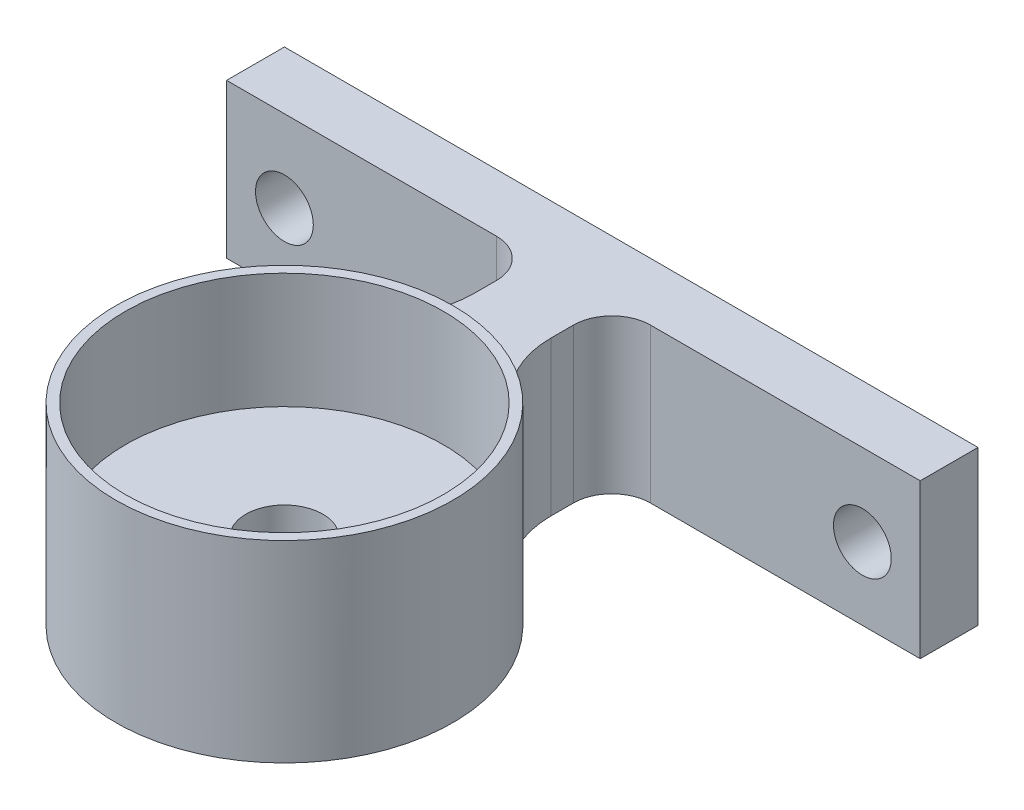
ISO-10303-21;
HEADER;
FILE_DESCRIPTION(('STEP AP214'),'2;1');
FILE_NAME('part.step','',(''),(''),'','','');
FILE_SCHEMA(('AUTOMOTIVE_DESIGN { 1 0 10303 214 1 1 1 1 }'));
ENDSEC;
DATA;
#1=APPLICATION_CONTEXT('core data for automotive mechanical design processes');
#2=APPLICATION_PROTOCOL_DEFINITION('international standard','automotive_design',2000,#1);
#3=PRODUCT_CONTEXT('',#1,'mechanical');
#4=PRODUCT('Part','Part','',(#3));
#5=PRODUCT_RELATED_PRODUCT_CATEGORY('part','',(#4));
#6=PRODUCT_DEFINITION_FORMATION('','',#4);
#7=PRODUCT_DEFINITION_CONTEXT('part definition',#1,'design');
#8=PRODUCT_DEFINITION('design','',#6,#7);
#9=PRODUCT_DEFINITION_SHAPE('','',#8);
#10=(LENGTH_UNIT() NAMED_UNIT(*) SI_UNIT(.MILLI.,.METRE.));
#11=(NAMED_UNIT(*) PLANE_ANGLE_UNIT() SI_UNIT($,.RADIAN.));
#12=(NAMED_UNIT(*) SI_UNIT($,.STERADIAN.) SOLID_ANGLE_UNIT());
#13=UNCERTAINTY_MEASURE_WITH_UNIT(LENGTH_MEASURE(1.E-05),#10,'distance_accuracy_value','');
#14=(GEOMETRIC_REPRESENTATION_CONTEXT(3) GLOBAL_UNCERTAINTY_ASSIGNED_CONTEXT((#13)) GLOBAL_UNIT_ASSIGNED_CONTEXT((#10,
#11,#12)) REPRESENTATION_CONTEXT('',''));
#15=CARTESIAN_POINT('',(0.,0.,0.));
#16=DIRECTION('',(0.,0.,1.));
#17=DIRECTION('',(1.,0.,0.));
#18=AXIS2_PLACEMENT_3D('',#15,#16,#17);
#19=CARTESIAN_POINT('',(-15.,8.,-18.));
#20=DIRECTION('',(0.,0.,1.));
#21=DIRECTION('',(1.,0.,0.));
#22=AXIS2_PLACEMENT_3D('',#19,#20,#21);
#23=PLANE('',#22);
#24=DIRECTION('',(-1.,0.,0.));
#25=VECTOR('',#24,1.);
#26=CARTESIAN_POINT('',(-15.,0.,-18.));
#27=LINE('',#26,#25);
#28=CARTESIAN_POINT('',(18.,0.,-18.));
#29=VERTEX_POINT('',#28);
#30=CARTESIAN_POINT('',(-18.,0.,-18.));
#31=VERTEX_POINT('',#30);
#32=EDGE_CURVE('E123',#29,#31,#27,.T.);
#33=ORIENTED_EDGE('',*,*,#32,.T.);
#34=DIRECTION('',(0.,-1.,0.));
#35=VECTOR('',#34,1.);
#36=CARTESIAN_POINT('',(-18.,8.,-18.));
#37=LINE('',#36,#35);
#38=CARTESIAN_POINT('',(-18.,8.,-18.));
#39=VERTEX_POINT('',#38);
#40=EDGE_CURVE('E127',#39,#31,#37,.T.);
#41=ORIENTED_EDGE('',*,*,#40,.F.);
#42=DIRECTION('',(-1.,0.,0.));
#43=VECTOR('',#42,1.);
#44=CARTESIAN_POINT('',(2.,8.,-18.));
#45=LINE('',#44,#43);
#46=CARTESIAN_POINT('',(18.,8.,-18.));
#47=VERTEX_POINT('',#46);
#48=EDGE_CURVE('E174',#47,#39,#45,.T.);
#49=ORIENTED_EDGE('',*,*,#48,.F.);
#50=DIRECTION('',(0.,1.,0.));
#51=VECTOR('',#50,1.);
#52=CARTESIAN_POINT('',(18.,8.,-18.));
#53=LINE('',#52,#51);
#54=EDGE_CURVE('E129',#29,#47,#53,.T.);
#55=ORIENTED_EDGE('',*,*,#54,.F.);
#56=EDGE_LOOP('',(#33,#41,#49,#55));
#57=FACE_BOUND('',#56,.T.);
#58=CARTESIAN_POINT('',(15.,3.75402103542641,-18.));
#59=DIRECTION('',(0.,0.,-1.));
#60=DIRECTION('',(-1.,0.,0.));
#61=AXIS2_PLACEMENT_3D('',#58,#59,#60);
#62=CIRCLE('',#61,1.5);
#63=CARTESIAN_POINT('',(13.5,3.75402103542641,-18.));
#64=VERTEX_POINT('',#63);
#65=EDGE_CURVE('E152',#64,#64,#62,.T.);
#66=ORIENTED_EDGE('',*,*,#65,.F.);
#67=EDGE_LOOP('',(#66));
#68=FACE_BOUND('',#67,.T.);
#69=CARTESIAN_POINT('',(-15.,3.75402103542641,-18.));
#70=DIRECTION('',(0.,0.,1.));
#71=DIRECTION('',(1.,0.,0.));
#72=AXIS2_PLACEMENT_3D('',#69,#70,#71);
#73=CIRCLE('',#72,1.5);
#74=CARTESIAN_POINT('',(-13.5,3.75402103542641,-18.));
#75=VERTEX_POINT('',#74);
#76=EDGE_CURVE('E494',#75,#75,#73,.T.);
#77=ORIENTED_EDGE('',*,*,#76,.T.);
#78=EDGE_LOOP('',(#77));
#79=FACE_BOUND('',#78,.T.);
#80=ADVANCED_FACE('F34',(#57,#68,#79),#23,.F.);
#81=CARTESIAN_POINT('',(-15.,8.,-15.));
#82=DIRECTION('',(0.,0.,-1.));
#83=DIRECTION('',(-1.,0.,0.));
#84=AXIS2_PLACEMENT_3D('',#81,#82,#83);
#85=PLANE('',#84);
#86=DIRECTION('',(1.,0.,0.));
#87=VECTOR('',#86,1.);
#88=CARTESIAN_POINT('',(-15.,0.,-15.));
#89=LINE('',#88,#87);
#90=CARTESIAN_POINT('',(-18.,0.,-15.));
#91=VERTEX_POINT('',#90);
#92=CARTESIAN_POINT('',(-4.,0.,-15.));
#93=VERTEX_POINT('',#92);
#94=EDGE_CURVE('E132',#91,#93,#89,.T.);
#95=ORIENTED_EDGE('',*,*,#94,.T.);
#96=DIRECTION('',(0.,-1.,0.));
#97=VECTOR('',#96,1.);
#98=CARTESIAN_POINT('',(-4.,8.,-15.));
#99=LINE('',#98,#97);
#100=CARTESIAN_POINT('',(-4.,8.,-15.));
#101=VERTEX_POINT('',#100);
#102=EDGE_CURVE('E229',#93,#101,#99,.F.);
#103=ORIENTED_EDGE('',*,*,#102,.T.);
#104=DIRECTION('',(1.,0.,0.));
#105=VECTOR('',#104,1.);
#106=CARTESIAN_POINT('',(-15.,8.,-15.));
#107=LINE('',#106,#105);
#108=CARTESIAN_POINT('',(-18.,8.,-15.));
#109=VERTEX_POINT('',#108);
#110=EDGE_CURVE('E176',#109,#101,#107,.T.);
#111=ORIENTED_EDGE('',*,*,#110,.F.);
#112=DIRECTION('',(0.,1.,0.));
#113=VECTOR('',#112,1.);
#114=CARTESIAN_POINT('',(-18.,8.,-15.));
#115=LINE('',#114,#113);
#116=EDGE_CURVE('E143',#91,#109,#115,.T.);
#117=ORIENTED_EDGE('',*,*,#116,.F.);
#118=EDGE_LOOP('',(#95,#103,#111,#117));
#119=FACE_BOUND('',#118,.T.);
#120=CARTESIAN_POINT('',(-15.,3.75402103542641,-15.));
#121=DIRECTION('',(0.,0.,1.));
#122=DIRECTION('',(1.,0.,0.));
#123=AXIS2_PLACEMENT_3D('',#120,#121,#122);
#124=CIRCLE('',#123,1.5);
#125=CARTESIAN_POINT('',(-13.5,3.75402103542641,-15.));
#126=VERTEX_POINT('',#125);
#127=EDGE_CURVE('E491',#126,#126,#124,.T.);
#128=ORIENTED_EDGE('',*,*,#127,.F.);
#129=EDGE_LOOP('',(#128));
#130=FACE_BOUND('',#129,.T.);
#131=ADVANCED_FACE('F252',(#119,#130),#85,.F.);
#132=CARTESIAN_POINT('',(0.,10.,0.));
#133=DIRECTION('',(0.,-1.,0.));
#134=DIRECTION('',(0.,0.,-1.));
#135=AXIS2_PLACEMENT_3D('',#132,#133,#134);
#136=CYLINDRICAL_SURFACE('',#135,8.75);
#137=CARTESIAN_POINT('',(0.,10.,0.));
#138=DIRECTION('',(0.,1.,0.));
#139=DIRECTION('',(0.,0.,1.));
#140=AXIS2_PLACEMENT_3D('',#137,#138,#139);
#141=CIRCLE('',#140,8.75);
#142=CARTESIAN_POINT('',(0.,10.,8.75));
#143=VERTEX_POINT('',#142);
#144=EDGE_CURVE('E194',#143,#143,#141,.T.);
#145=ORIENTED_EDGE('',*,*,#144,.F.);
#146=EDGE_LOOP('',(#145));
#147=FACE_BOUND('',#146,.T.);
#148=CARTESIAN_POINT('',(0.,0.,0.));
#149=DIRECTION('',(0.,1.,0.));
#150=DIRECTION('',(0.,0.,1.));
#151=AXIS2_PLACEMENT_3D('',#148,#149,#150);
#152=CIRCLE('',#151,8.75);
#153=CARTESIAN_POINT('',(-4.45454545454546,0.,-7.5312366045284));
#154=VERTEX_POINT('',#153);
#155=CARTESIAN_POINT('',(4.45454545454546,0.,-7.5312366045284));
#156=VERTEX_POINT('',#155);
#157=EDGE_CURVE('E193',#154,#156,#152,.T.);
#158=ORIENTED_EDGE('',*,*,#157,.T.);
#159=DIRECTION('',(0.,-1.,0.));
#160=VECTOR('',#159,1.);
#161=CARTESIAN_POINT('',(4.45454545454546,10.,-7.5312366045284));
#162=LINE('',#161,#160);
#163=CARTESIAN_POINT('',(4.45454545454546,8.,-7.5312366045284));
#164=VERTEX_POINT('',#163);
#165=EDGE_CURVE('E210',#156,#164,#162,.F.);
#166=ORIENTED_EDGE('',*,*,#165,.T.);
#167=CARTESIAN_POINT('',(0.,8.,0.));
#168=DIRECTION('',(0.,-1.,0.));
#169=DIRECTION('',(0.,0.,-1.));
#170=AXIS2_PLACEMENT_3D('',#167,#168,#169);
#171=CIRCLE('',#170,8.75);
#172=CARTESIAN_POINT('',(-4.45454545454546,8.,-7.5312366045284));
#173=VERTEX_POINT('',#172);
#174=EDGE_CURVE('E202',#173,#164,#171,.T.);
#175=ORIENTED_EDGE('',*,*,#174,.F.);
#176=DIRECTION('',(0.,-1.,0.));
#177=VECTOR('',#176,1.);
#178=CARTESIAN_POINT('',(-4.45454545454546,10.,-7.5312366045284));
#179=LINE('',#178,#177);
#180=EDGE_CURVE('E207',#173,#154,#179,.T.);
#181=ORIENTED_EDGE('',*,*,#180,.T.);
#182=EDGE_LOOP('',(#158,#166,#175,#181));
#183=FACE_BOUND('',#182,.T.);
#184=ADVANCED_FACE('F272',(#147,#183),#136,.T.);
#185=CARTESIAN_POINT('',(0.,10.,0.));
#186=DIRECTION('',(0.,1.,0.));
#187=DIRECTION('',(0.,0.,1.));
#188=AXIS2_PLACEMENT_3D('',#185,#186,#187);
#189=PLANE('',#188);
#190=ORIENTED_EDGE('',*,*,#144,.T.);
#191=EDGE_LOOP('',(#190));
#192=FACE_BOUND('',#191,.T.);
#193=CARTESIAN_POINT('',(0.,10.,0.));
#194=DIRECTION('',(0.,1.,0.));
#195=DIRECTION('',(0.,0.,1.));
#196=AXIS2_PLACEMENT_3D('',#193,#194,#195);
#197=CIRCLE('',#196,8.25);
#198=CARTESIAN_POINT('',(0.,10.,8.25));
#199=VERTEX_POINT('',#198);
#200=EDGE_CURVE('E188',#199,#199,#197,.T.);
#201=ORIENTED_EDGE('',*,*,#200,.F.);
#202=EDGE_LOOP('',(#201));
#203=FACE_BOUND('',#202,.T.);
#204=ADVANCED_FACE('F311',(#192,#203),#189,.T.);
#205=CARTESIAN_POINT('',(0.,0.,0.));
#206=DIRECTION('',(0.,1.,0.));
#207=DIRECTION('',(0.,0.,1.));
#208=AXIS2_PLACEMENT_3D('',#205,#206,#207);
#209=PLANE('',#208);
#210=DIRECTION('',(0.,0.,-1.));
#211=VECTOR('',#210,1.);
#212=CARTESIAN_POINT('',(2.,0.,-8.51836251870041));
#213=LINE('',#212,#211);
#214=CARTESIAN_POINT('',(2.,0.,-11.8348003785446));
#215=VERTEX_POINT('',#214);
#216=CARTESIAN_POINT('',(2.,0.,-13.));
#217=VERTEX_POINT('',#216);
#218=EDGE_CURVE('E181',#215,#217,#213,.T.);
#219=ORIENTED_EDGE('',*,*,#218,.F.);
#220=CARTESIAN_POINT('',(7.,0.,-11.8348003785446));
#221=DIRECTION('',(0.,1.,0.));
#222=DIRECTION('',(0.,0.,1.));
#223=AXIS2_PLACEMENT_3D('',#220,#221,#222);
#224=CIRCLE('',#223,5.);
#225=EDGE_CURVE('E216',#215,#156,#224,.T.);
#226=ORIENTED_EDGE('',*,*,#225,.T.);
#227=ORIENTED_EDGE('',*,*,#157,.F.);
#228=CARTESIAN_POINT('',(-7.,0.,-11.8348003785446));
#229=DIRECTION('',(0.,1.,0.));
#230=DIRECTION('',(0.,0.,1.));
#231=AXIS2_PLACEMENT_3D('',#228,#229,#230);
#232=CIRCLE('',#231,5.);
#233=CARTESIAN_POINT('',(-2.,0.,-11.8348003785446));
#234=VERTEX_POINT('',#233);
#235=EDGE_CURVE('E220',#154,#234,#232,.T.);
#236=ORIENTED_EDGE('',*,*,#235,.T.);
#237=DIRECTION('',(0.,0.,1.));
#238=VECTOR('',#237,1.);
#239=CARTESIAN_POINT('',(-2.,0.,-8.51836251870041));
#240=LINE('',#239,#238);
#241=CARTESIAN_POINT('',(-2.,0.,-13.));
#242=VERTEX_POINT('',#241);
#243=EDGE_CURVE('E167',#242,#234,#240,.T.);
#244=ORIENTED_EDGE('',*,*,#243,.F.);
#245=CARTESIAN_POINT('',(-4.,0.,-13.));
#246=DIRECTION('',(0.,1.,0.));
#247=DIRECTION('',(0.,0.,1.));
#248=AXIS2_PLACEMENT_3D('',#245,#246,#247);
#249=CIRCLE('',#248,2.);
#250=EDGE_CURVE('E235',#242,#93,#249,.T.);
#251=ORIENTED_EDGE('',*,*,#250,.T.);
#252=ORIENTED_EDGE('',*,*,#94,.F.);
#253=DIRECTION('',(0.,0.,1.));
#254=VECTOR('',#253,1.);
#255=CARTESIAN_POINT('',(-18.,0.,-18.));
#256=LINE('',#255,#254);
#257=EDGE_CURVE('E136',#31,#91,#256,.T.);
#258=ORIENTED_EDGE('',*,*,#257,.F.);
#259=ORIENTED_EDGE('',*,*,#32,.F.);
#260=DIRECTION('',(0.,0.,-1.));
#261=VECTOR('',#260,1.);
#262=CARTESIAN_POINT('',(18.,0.,-15.));
#263=LINE('',#262,#261);
#264=CARTESIAN_POINT('',(18.,0.,-15.));
#265=VERTEX_POINT('',#264);
#266=EDGE_CURVE('E161',#265,#29,#263,.T.);
#267=ORIENTED_EDGE('',*,*,#266,.F.);
#268=DIRECTION('',(1.,0.,0.));
#269=VECTOR('',#268,1.);
#270=CARTESIAN_POINT('',(2.,0.,-15.));
#271=LINE('',#270,#269);
#272=CARTESIAN_POINT('',(4.,0.,-15.));
#273=VERTEX_POINT('',#272);
#274=EDGE_CURVE('E133',#273,#265,#271,.T.);
#275=ORIENTED_EDGE('',*,*,#274,.F.);
#276=CARTESIAN_POINT('',(4.,0.,-13.));
#277=DIRECTION('',(0.,1.,0.));
#278=DIRECTION('',(0.,0.,1.));
#279=AXIS2_PLACEMENT_3D('',#276,#277,#278);
#280=CIRCLE('',#279,2.);
#281=EDGE_CURVE('E42',#273,#217,#280,.T.);
#282=ORIENTED_EDGE('',*,*,#281,.T.);
#283=EDGE_LOOP('',(#219,#226,#227,#236,#244,#251,#252,#258,#259,#267,#275,#282));
#284=FACE_BOUND('',#283,.T.);
#285=CARTESIAN_POINT('',(0.,0.,0.));
#286=DIRECTION('',(0.,1.,0.));
#287=DIRECTION('',(0.,0.,1.));
#288=AXIS2_PLACEMENT_3D('',#285,#286,#287);
#289=CIRCLE('',#288,2.);
#290=CARTESIAN_POINT('',(0.,0.,2.));
#291=VERTEX_POINT('',#290);
#292=EDGE_CURVE('E179',#291,#291,#289,.T.);
#293=ORIENTED_EDGE('',*,*,#292,.T.);
#294=EDGE_LOOP('',(#293));
#295=FACE_BOUND('',#294,.T.);
#296=ADVANCED_FACE('F137',(#284,#295),#209,.F.);
#297=CARTESIAN_POINT('',(0.,10.,0.));
#298=DIRECTION('',(0.,-1.,0.));
#299=DIRECTION('',(0.,0.,-1.));
#300=AXIS2_PLACEMENT_3D('',#297,#298,#299);
#301=CYLINDRICAL_SURFACE('',#300,8.25);
#302=CARTESIAN_POINT('',(0.,4.,0.));
#303=DIRECTION('',(0.,1.,0.));
#304=DIRECTION('',(0.,0.,1.));
#305=AXIS2_PLACEMENT_3D('',#302,#303,#304);
#306=CIRCLE('',#305,8.25);
#307=CARTESIAN_POINT('',(0.,4.,8.25));
#308=VERTEX_POINT('',#307);
#309=EDGE_CURVE('E197',#308,#308,#306,.T.);
#310=ORIENTED_EDGE('',*,*,#309,.F.);
#311=EDGE_LOOP('',(#310));
#312=FACE_BOUND('',#311,.T.);
#313=ORIENTED_EDGE('',*,*,#200,.T.);
#314=EDGE_LOOP('',(#313));
#315=FACE_BOUND('',#314,.T.);
#316=ADVANCED_FACE('F306',(#312,#315),#301,.F.);
#317=CARTESIAN_POINT('',(0.,4.,0.));
#318=DIRECTION('',(0.,1.,0.));
#319=DIRECTION('',(0.,0.,1.));
#320=AXIS2_PLACEMENT_3D('',#317,#318,#319);
#321=PLANE('',#320);
#322=ORIENTED_EDGE('',*,*,#309,.T.);
#323=EDGE_LOOP('',(#322));
#324=FACE_BOUND('',#323,.T.);
#325=CARTESIAN_POINT('',(0.,4.,0.));
#326=DIRECTION('',(0.,1.,0.));
#327=DIRECTION('',(0.,0.,1.));
#328=AXIS2_PLACEMENT_3D('',#325,#326,#327);
#329=CIRCLE('',#328,2.);
#330=CARTESIAN_POINT('',(0.,4.,2.));
#331=VERTEX_POINT('',#330);
#332=EDGE_CURVE('E185',#331,#331,#329,.T.);
#333=ORIENTED_EDGE('',*,*,#332,.F.);
#334=EDGE_LOOP('',(#333));
#335=FACE_BOUND('',#334,.T.);
#336=ADVANCED_FACE('F302',(#324,#335),#321,.T.);
#337=CARTESIAN_POINT('',(0.,4.,0.));
#338=DIRECTION('',(0.,-1.,0.));
#339=DIRECTION('',(0.,0.,-1.));
#340=AXIS2_PLACEMENT_3D('',#337,#338,#339);
#341=CYLINDRICAL_SURFACE('',#340,2.);
#342=ORIENTED_EDGE('',*,*,#332,.T.);
#343=EDGE_LOOP('',(#342));
#344=FACE_BOUND('',#343,.T.);
#345=ORIENTED_EDGE('',*,*,#292,.F.);
#346=EDGE_LOOP('',(#345));
#347=FACE_BOUND('',#346,.T.);
#348=ADVANCED_FACE('F299',(#344,#347),#341,.F.);
#349=CARTESIAN_POINT('',(0.,8.,0.));
#350=DIRECTION('',(0.,-1.,0.));
#351=DIRECTION('',(0.,0.,-1.));
#352=AXIS2_PLACEMENT_3D('',#349,#350,#351);
#353=PLANE('',#352);
#354=ORIENTED_EDGE('',*,*,#110,.T.);
#355=CARTESIAN_POINT('',(-4.,8.,-13.));
#356=DIRECTION('',(0.,-1.,0.));
#357=DIRECTION('',(0.,0.,-1.));
#358=AXIS2_PLACEMENT_3D('',#355,#356,#357);
#359=CIRCLE('',#358,2.);
#360=CARTESIAN_POINT('',(-2.,8.,-13.));
#361=VERTEX_POINT('',#360);
#362=EDGE_CURVE('E237',#101,#361,#359,.T.);
#363=ORIENTED_EDGE('',*,*,#362,.T.);
#364=DIRECTION('',(0.,0.,1.));
#365=VECTOR('',#364,1.);
#366=CARTESIAN_POINT('',(-2.,8.,-8.51836251870041));
#367=LINE('',#366,#365);
#368=CARTESIAN_POINT('',(-2.,8.,-11.8348003785446));
#369=VERTEX_POINT('',#368);
#370=EDGE_CURVE('E168',#361,#369,#367,.T.);
#371=ORIENTED_EDGE('',*,*,#370,.T.);
#372=CARTESIAN_POINT('',(-7.,8.,-11.8348003785446));
#373=DIRECTION('',(0.,-1.,0.));
#374=DIRECTION('',(0.,0.,-1.));
#375=AXIS2_PLACEMENT_3D('',#372,#373,#374);
#376=CIRCLE('',#375,5.);
#377=EDGE_CURVE('E223',#369,#173,#376,.T.);
#378=ORIENTED_EDGE('',*,*,#377,.T.);
#379=ORIENTED_EDGE('',*,*,#174,.T.);
#380=CARTESIAN_POINT('',(7.,8.,-11.8348003785446));
#381=DIRECTION('',(0.,-1.,0.));
#382=DIRECTION('',(0.,0.,-1.));
#383=AXIS2_PLACEMENT_3D('',#380,#381,#382);
#384=CIRCLE('',#383,5.);
#385=CARTESIAN_POINT('',(2.,8.,-11.8348003785446));
#386=VERTEX_POINT('',#385);
#387=EDGE_CURVE('E218',#164,#386,#384,.T.);
#388=ORIENTED_EDGE('',*,*,#387,.T.);
#389=DIRECTION('',(0.,0.,-1.));
#390=VECTOR('',#389,1.);
#391=CARTESIAN_POINT('',(2.,8.,-8.51836251870041));
#392=LINE('',#391,#390);
#393=CARTESIAN_POINT('',(2.,8.,-13.));
#394=VERTEX_POINT('',#393);
#395=EDGE_CURVE('E170',#386,#394,#392,.T.);
#396=ORIENTED_EDGE('',*,*,#395,.T.);
#397=CARTESIAN_POINT('',(4.,8.,-13.));
#398=DIRECTION('',(0.,-1.,0.));
#399=DIRECTION('',(0.,0.,-1.));
#400=AXIS2_PLACEMENT_3D('',#397,#398,#399);
#401=CIRCLE('',#400,2.);
#402=CARTESIAN_POINT('',(4.,8.,-15.));
#403=VERTEX_POINT('',#402);
#404=EDGE_CURVE('E11',#394,#403,#401,.T.);
#405=ORIENTED_EDGE('',*,*,#404,.T.);
#406=DIRECTION('',(1.,0.,0.));
#407=VECTOR('',#406,1.);
#408=CARTESIAN_POINT('',(2.,8.,-15.));
#409=LINE('',#408,#407);
#410=CARTESIAN_POINT('',(18.,8.,-15.));
#411=VERTEX_POINT('',#410);
#412=EDGE_CURVE('E172',#403,#411,#409,.T.);
#413=ORIENTED_EDGE('',*,*,#412,.T.);
#414=DIRECTION('',(0.,0.,1.));
#415=VECTOR('',#414,1.);
#416=CARTESIAN_POINT('',(18.,8.,-15.));
#417=LINE('',#416,#415);
#418=EDGE_CURVE('E164',#47,#411,#417,.T.);
#419=ORIENTED_EDGE('',*,*,#418,.F.);
#420=ORIENTED_EDGE('',*,*,#48,.T.);
#421=DIRECTION('',(0.,0.,-1.));
#422=VECTOR('',#421,1.);
#423=CARTESIAN_POINT('',(-18.,8.,-18.));
#424=LINE('',#423,#422);
#425=EDGE_CURVE('E148',#109,#39,#424,.T.);
#426=ORIENTED_EDGE('',*,*,#425,.F.);
#427=EDGE_LOOP('',(#354,#363,#371,#378,#379,#388,#396,#405,#413,#419,#420,#426));
#428=FACE_BOUND('',#427,.T.);
#429=ADVANCED_FACE('F241',(#428),#353,.F.);
#430=CARTESIAN_POINT('',(-2.,8.,-8.51836251870041));
#431=DIRECTION('',(1.,0.,0.));
#432=DIRECTION('',(0.,0.,-1.));
#433=AXIS2_PLACEMENT_3D('',#430,#431,#432);
#434=PLANE('',#433);
#435=ORIENTED_EDGE('',*,*,#370,.F.);
#436=DIRECTION('',(0.,-1.,0.));
#437=VECTOR('',#436,1.);
#438=CARTESIAN_POINT('',(-2.,0.,-13.));
#439=LINE('',#438,#437);
#440=EDGE_CURVE('E226',#361,#242,#439,.T.);
#441=ORIENTED_EDGE('',*,*,#440,.T.);
#442=ORIENTED_EDGE('',*,*,#243,.T.);
#443=DIRECTION('',(0.,1.,0.));
#444=VECTOR('',#443,1.);
#445=CARTESIAN_POINT('',(-2.,8.,-11.8348003785446));
#446=LINE('',#445,#444);
#447=EDGE_CURVE('E213',#234,#369,#446,.T.);
#448=ORIENTED_EDGE('',*,*,#447,.T.);
#449=EDGE_LOOP('',(#435,#441,#442,#448));
#450=FACE_BOUND('',#449,.T.);
#451=ADVANCED_FACE('F246',(#450),#434,.F.);
#452=CARTESIAN_POINT('',(2.,8.,-8.51836251870041));
#453=DIRECTION('',(-1.,0.,0.));
#454=DIRECTION('',(0.,0.,1.));
#455=AXIS2_PLACEMENT_3D('',#452,#453,#454);
#456=PLANE('',#455);
#457=ORIENTED_EDGE('',*,*,#218,.T.);
#458=DIRECTION('',(0.,-1.,0.));
#459=VECTOR('',#458,1.);
#460=CARTESIAN_POINT('',(2.,8.,-13.));
#461=LINE('',#460,#459);
#462=EDGE_CURVE('E55',#217,#394,#461,.F.);
#463=ORIENTED_EDGE('',*,*,#462,.T.);
#464=ORIENTED_EDGE('',*,*,#395,.F.);
#465=DIRECTION('',(0.,1.,0.));
#466=VECTOR('',#465,1.);
#467=CARTESIAN_POINT('',(2.,0.,-11.8348003785446));
#468=LINE('',#467,#466);
#469=EDGE_CURVE('E204',#386,#215,#468,.F.);
#470=ORIENTED_EDGE('',*,*,#469,.T.);
#471=EDGE_LOOP('',(#457,#463,#464,#470));
#472=FACE_BOUND('',#471,.T.);
#473=ADVANCED_FACE('F266',(#472),#456,.F.);
#474=CARTESIAN_POINT('',(2.,8.,-15.));
#475=DIRECTION('',(0.,0.,-1.));
#476=DIRECTION('',(-1.,0.,0.));
#477=AXIS2_PLACEMENT_3D('',#474,#475,#476);
#478=PLANE('',#477);
#479=CARTESIAN_POINT('',(15.,3.75402103542641,-15.));
#480=DIRECTION('',(0.,0.,-1.));
#481=DIRECTION('',(-1.,0.,0.));
#482=AXIS2_PLACEMENT_3D('',#479,#480,#481);
#483=CIRCLE('',#482,1.5);
#484=CARTESIAN_POINT('',(13.5,3.75402103542641,-15.));
#485=VERTEX_POINT('',#484);
#486=EDGE_CURVE('E149',#485,#485,#483,.T.);
#487=ORIENTED_EDGE('',*,*,#486,.T.);
#488=EDGE_LOOP('',(#487));
#489=FACE_BOUND('',#488,.T.);
#490=ORIENTED_EDGE('',*,*,#412,.F.);
#491=DIRECTION('',(0.,-1.,0.));
#492=VECTOR('',#491,1.);
#493=CARTESIAN_POINT('',(4.,0.,-15.));
#494=LINE('',#493,#492);
#495=EDGE_CURVE('E231',#403,#273,#494,.T.);
#496=ORIENTED_EDGE('',*,*,#495,.T.);
#497=ORIENTED_EDGE('',*,*,#274,.T.);
#498=DIRECTION('',(0.,-1.,0.));
#499=VECTOR('',#498,1.);
#500=CARTESIAN_POINT('',(18.,8.,-15.));
#501=LINE('',#500,#499);
#502=EDGE_CURVE('E158',#411,#265,#501,.T.);
#503=ORIENTED_EDGE('',*,*,#502,.F.);
#504=EDGE_LOOP('',(#490,#496,#497,#503));
#505=FACE_BOUND('',#504,.T.);
#506=ADVANCED_FACE('F260',(#489,#505),#478,.F.);
#507=CARTESIAN_POINT('',(18.,0.,0.));
#508=DIRECTION('',(1.,0.,0.));
#509=DIRECTION('',(0.,0.,-1.));
#510=AXIS2_PLACEMENT_3D('',#507,#508,#509);
#511=PLANE('',#510);
#512=ORIENTED_EDGE('',*,*,#502,.T.);
#513=ORIENTED_EDGE('',*,*,#266,.T.);
#514=ORIENTED_EDGE('',*,*,#54,.T.);
#515=ORIENTED_EDGE('',*,*,#418,.T.);
#516=EDGE_LOOP('',(#512,#513,#514,#515));
#517=FACE_BOUND('',#516,.T.);
#518=ADVANCED_FACE('F256',(#517),#511,.T.);
#519=CARTESIAN_POINT('',(-18.,0.,0.));
#520=DIRECTION('',(-1.,0.,0.));
#521=DIRECTION('',(0.,0.,1.));
#522=AXIS2_PLACEMENT_3D('',#519,#520,#521);
#523=PLANE('',#522);
#524=ORIENTED_EDGE('',*,*,#40,.T.);
#525=ORIENTED_EDGE('',*,*,#257,.T.);
#526=ORIENTED_EDGE('',*,*,#116,.T.);
#527=ORIENTED_EDGE('',*,*,#425,.T.);
#528=EDGE_LOOP('',(#524,#525,#526,#527));
#529=FACE_BOUND('',#528,.T.);
#530=ADVANCED_FACE('F146',(#529),#523,.T.);
#531=CARTESIAN_POINT('',(15.,3.75402103542641,-15.));
#532=DIRECTION('',(0.,0.,-1.));
#533=DIRECTION('',(-1.,0.,0.));
#534=AXIS2_PLACEMENT_3D('',#531,#532,#533);
#535=CYLINDRICAL_SURFACE('',#534,1.5);
#536=ORIENTED_EDGE('',*,*,#486,.F.);
#537=EDGE_LOOP('',(#536));
#538=FACE_BOUND('',#537,.T.);
#539=ORIENTED_EDGE('',*,*,#65,.T.);
#540=EDGE_LOOP('',(#539));
#541=FACE_BOUND('',#540,.T.);
#542=ADVANCED_FACE('F379',(#538,#541),#535,.F.);
#543=CARTESIAN_POINT('',(-15.,3.75402103542641,-15.));
#544=DIRECTION('',(0.,0.,-1.));
#545=DIRECTION('',(-1.,0.,0.));
#546=AXIS2_PLACEMENT_3D('',#543,#544,#545);
#547=CYLINDRICAL_SURFACE('',#546,1.5);
#548=ORIENTED_EDGE('',*,*,#127,.T.);
#549=EDGE_LOOP('',(#548));
#550=FACE_BOUND('',#549,.T.);
#551=ORIENTED_EDGE('',*,*,#76,.F.);
#552=EDGE_LOOP('',(#551));
#553=FACE_BOUND('',#552,.T.);
#554=ADVANCED_FACE('F282',(#550,#553),#547,.F.);
#555=CARTESIAN_POINT('',(7.,10.,-11.8348003785446));
#556=DIRECTION('',(0.,-1.,0.));
#557=DIRECTION('',(0.,0.,-1.));
#558=AXIS2_PLACEMENT_3D('',#555,#556,#557);
#559=CYLINDRICAL_SURFACE('',#558,5.);
#560=ORIENTED_EDGE('',*,*,#387,.F.);
#561=ORIENTED_EDGE('',*,*,#165,.F.);
#562=ORIENTED_EDGE('',*,*,#225,.F.);
#563=ORIENTED_EDGE('',*,*,#469,.F.);
#564=EDGE_LOOP('',(#560,#561,#562,#563));
#565=FACE_BOUND('',#564,.T.);
#566=ADVANCED_FACE('F268',(#565),#559,.F.);
#567=CARTESIAN_POINT('',(-7.,10.,-11.8348003785446));
#568=DIRECTION('',(0.,-1.,0.));
#569=DIRECTION('',(0.,0.,-1.));
#570=AXIS2_PLACEMENT_3D('',#567,#568,#569);
#571=CYLINDRICAL_SURFACE('',#570,5.);
#572=ORIENTED_EDGE('',*,*,#377,.F.);
#573=ORIENTED_EDGE('',*,*,#447,.F.);
#574=ORIENTED_EDGE('',*,*,#235,.F.);
#575=ORIENTED_EDGE('',*,*,#180,.F.);
#576=EDGE_LOOP('',(#572,#573,#574,#575));
#577=FACE_BOUND('',#576,.T.);
#578=ADVANCED_FACE('F275',(#577),#571,.F.);
#579=CARTESIAN_POINT('',(-4.,8.,-13.));
#580=DIRECTION('',(0.,1.,0.));
#581=DIRECTION('',(0.,0.,1.));
#582=AXIS2_PLACEMENT_3D('',#579,#580,#581);
#583=CYLINDRICAL_SURFACE('',#582,2.);
#584=ORIENTED_EDGE('',*,*,#362,.F.);
#585=ORIENTED_EDGE('',*,*,#102,.F.);
#586=ORIENTED_EDGE('',*,*,#250,.F.);
#587=ORIENTED_EDGE('',*,*,#440,.F.);
#588=EDGE_LOOP('',(#584,#585,#586,#587));
#589=FACE_BOUND('',#588,.T.);
#590=ADVANCED_FACE('F250',(#589),#583,.F.);
#591=CARTESIAN_POINT('',(4.,8.,-13.));
#592=DIRECTION('',(0.,1.,0.));
#593=DIRECTION('',(0.,0.,1.));
#594=AXIS2_PLACEMENT_3D('',#591,#592,#593);
#595=CYLINDRICAL_SURFACE('',#594,2.);
#596=ORIENTED_EDGE('',*,*,#404,.F.);
#597=ORIENTED_EDGE('',*,*,#462,.F.);
#598=ORIENTED_EDGE('',*,*,#281,.F.);
#599=ORIENTED_EDGE('',*,*,#495,.F.);
#600=EDGE_LOOP('',(#596,#597,#598,#599));
#601=FACE_BOUND('',#600,.T.);
#602=ADVANCED_FACE('F36',(#601),#595,.F.);
#603=CLOSED_SHELL('',(#80,#131,#184,#204,#296,#316,#336,#348,#429,#451,#473,#506,#518,#530,#542,
#554,#566,#578,#590,#602));
#604=MANIFOLD_SOLID_BREP('B2',#603);
#605=ADVANCED_BREP_SHAPE_REPRESENTATION('',(#18,#604),#14);
#606=SHAPE_DEFINITION_REPRESENTATION(#9,#605);
ENDSEC;
END-ISO-10303-21;
